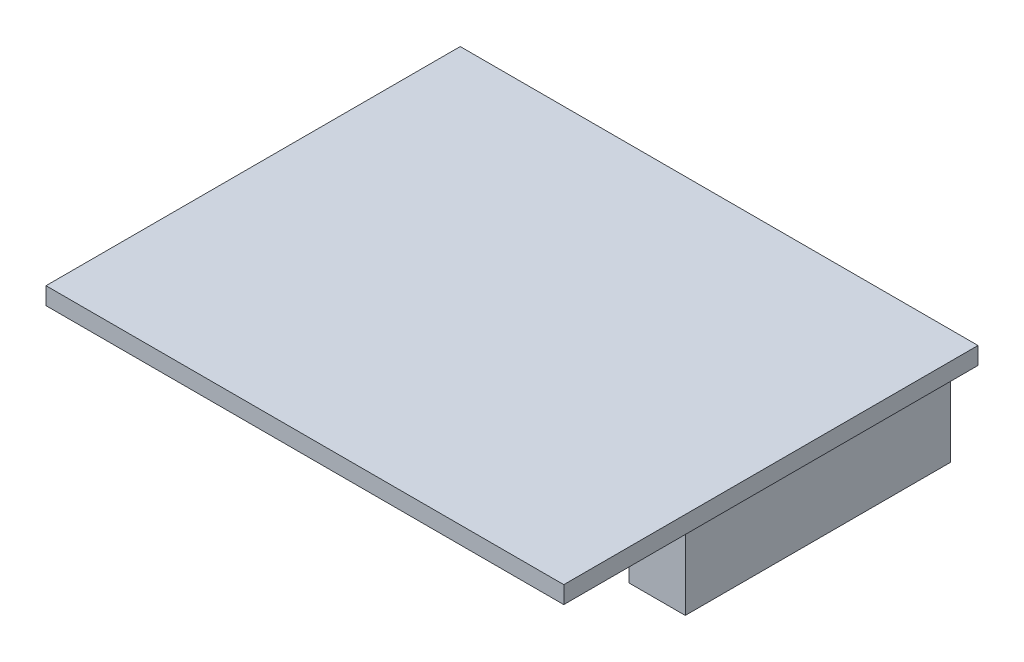
ISO-10303-21;
HEADER;
FILE_DESCRIPTION(('STEP AP214'),'2;1');
FILE_NAME('part.step','',(''),(''),'','','');
FILE_SCHEMA(('AUTOMOTIVE_DESIGN { 1 0 10303 214 1 1 1 1 }'));
ENDSEC;
DATA;
#1=APPLICATION_CONTEXT('core data for automotive mechanical design processes');
#2=APPLICATION_PROTOCOL_DEFINITION('international standard','automotive_design',2000,#1);
#3=PRODUCT_CONTEXT('',#1,'mechanical');
#4=PRODUCT('Part','Part','',(#3));
#5=PRODUCT_RELATED_PRODUCT_CATEGORY('part','',(#4));
#6=PRODUCT_DEFINITION_FORMATION('','',#4);
#7=PRODUCT_DEFINITION_CONTEXT('part definition',#1,'design');
#8=PRODUCT_DEFINITION('design','',#6,#7);
#9=PRODUCT_DEFINITION_SHAPE('','',#8);
#10=(LENGTH_UNIT() NAMED_UNIT(*) SI_UNIT(.MILLI.,.METRE.));
#11=(NAMED_UNIT(*) PLANE_ANGLE_UNIT() SI_UNIT($,.RADIAN.));
#12=(NAMED_UNIT(*) SI_UNIT($,.STERADIAN.) SOLID_ANGLE_UNIT());
#13=UNCERTAINTY_MEASURE_WITH_UNIT(LENGTH_MEASURE(1.E-05),#10,'distance_accuracy_value','');
#14=(GEOMETRIC_REPRESENTATION_CONTEXT(3) GLOBAL_UNCERTAINTY_ASSIGNED_CONTEXT((#13)) GLOBAL_UNIT_ASSIGNED_CONTEXT((#10,
#11,#12)) REPRESENTATION_CONTEXT('',''));
#15=CARTESIAN_POINT('',(0.,0.,0.));
#16=DIRECTION('',(0.,0.,1.));
#17=DIRECTION('',(1.,0.,0.));
#18=AXIS2_PLACEMENT_3D('',#15,#16,#17);
#19=CARTESIAN_POINT('',(0.,0.,0.));
#20=DIRECTION('',(0.,-1.,0.));
#21=DIRECTION('',(0.,0.,-1.));
#22=AXIS2_PLACEMENT_3D('',#19,#20,#21);
#23=PLANE('',#22);
#24=DIRECTION('',(0.,0.,-1.));
#25=VECTOR('',#24,1.);
#26=CARTESIAN_POINT('',(25.4,0.,20.32));
#27=LINE('',#26,#25);
#28=CARTESIAN_POINT('',(25.4,0.,20.32));
#29=VERTEX_POINT('',#28);
#30=CARTESIAN_POINT('',(25.4,0.,-20.32));
#31=VERTEX_POINT('',#30);
#32=EDGE_CURVE('E191',#29,#31,#27,.T.);
#33=ORIENTED_EDGE('',*,*,#32,.F.);
#34=DIRECTION('',(1.,0.,0.));
#35=VECTOR('',#34,1.);
#36=CARTESIAN_POINT('',(-25.4,0.,20.32));
#37=LINE('',#36,#35);
#38=CARTESIAN_POINT('',(-25.4,0.,20.32));
#39=VERTEX_POINT('',#38);
#40=EDGE_CURVE('E196',#39,#29,#37,.T.);
#41=ORIENTED_EDGE('',*,*,#40,.F.);
#42=DIRECTION('',(0.,0.,1.));
#43=VECTOR('',#42,1.);
#44=CARTESIAN_POINT('',(-25.4,0.,20.32));
#45=LINE('',#44,#43);
#46=CARTESIAN_POINT('',(-25.4,0.,-20.32));
#47=VERTEX_POINT('',#46);
#48=EDGE_CURVE('E207',#47,#39,#45,.T.);
#49=ORIENTED_EDGE('',*,*,#48,.F.);
#50=DIRECTION('',(-1.,0.,0.));
#51=VECTOR('',#50,1.);
#52=CARTESIAN_POINT('',(-25.4,0.,-20.32));
#53=LINE('',#52,#51);
#54=EDGE_CURVE('E205',#31,#47,#53,.T.);
#55=ORIENTED_EDGE('',*,*,#54,.F.);
#56=EDGE_LOOP('',(#33,#41,#49,#55));
#57=FACE_BOUND('',#56,.T.);
#58=DIRECTION('',(-1.,0.,0.));
#59=VECTOR('',#58,1.);
#60=CARTESIAN_POINT('',(-24.4,0.,6.68));
#61=LINE('',#60,#59);
#62=CARTESIAN_POINT('',(-19.4,0.,6.68));
#63=VERTEX_POINT('',#62);
#64=CARTESIAN_POINT('',(-24.4,0.,6.68));
#65=VERTEX_POINT('',#64);
#66=EDGE_CURVE('E177',#63,#65,#61,.T.);
#67=ORIENTED_EDGE('',*,*,#66,.F.);
#68=DIRECTION('',(0.,0.,1.));
#69=VECTOR('',#68,1.);
#70=CARTESIAN_POINT('',(-19.4,0.,-19.32));
#71=LINE('',#70,#69);
#72=CARTESIAN_POINT('',(-19.4,0.,-19.32));
#73=VERTEX_POINT('',#72);
#74=EDGE_CURVE('E174',#73,#63,#71,.T.);
#75=ORIENTED_EDGE('',*,*,#74,.F.);
#76=DIRECTION('',(1.,0.,0.));
#77=VECTOR('',#76,1.);
#78=CARTESIAN_POINT('',(-24.4,0.,-19.32));
#79=LINE('',#78,#77);
#80=CARTESIAN_POINT('',(-24.4,0.,-19.32));
#81=VERTEX_POINT('',#80);
#82=EDGE_CURVE('E167',#81,#73,#79,.T.);
#83=ORIENTED_EDGE('',*,*,#82,.F.);
#84=DIRECTION('',(0.,0.,-1.));
#85=VECTOR('',#84,1.);
#86=CARTESIAN_POINT('',(-24.4,0.,-19.32));
#87=LINE('',#86,#85);
#88=EDGE_CURVE('E180',#65,#81,#87,.T.);
#89=ORIENTED_EDGE('',*,*,#88,.F.);
#90=EDGE_LOOP('',(#67,#75,#83,#89));
#91=FACE_BOUND('',#90,.T.);
#92=DIRECTION('',(0.,0.,1.));
#93=VECTOR('',#92,1.);
#94=CARTESIAN_POINT('',(23.68,0.,-19.32));
#95=LINE('',#94,#93);
#96=CARTESIAN_POINT('',(23.68,0.,-19.32));
#97=VERTEX_POINT('',#96);
#98=CARTESIAN_POINT('',(23.68,0.,6.68));
#99=VERTEX_POINT('',#98);
#100=EDGE_CURVE('E144',#97,#99,#95,.T.);
#101=ORIENTED_EDGE('',*,*,#100,.F.);
#102=DIRECTION('',(1.,0.,0.));
#103=VECTOR('',#102,1.);
#104=CARTESIAN_POINT('',(18.18,0.,-19.32));
#105=LINE('',#104,#103);
#106=CARTESIAN_POINT('',(18.18,0.,-19.32));
#107=VERTEX_POINT('',#106);
#108=EDGE_CURVE('E53',#107,#97,#105,.T.);
#109=ORIENTED_EDGE('',*,*,#108,.F.);
#110=DIRECTION('',(0.,0.,-1.));
#111=VECTOR('',#110,1.);
#112=CARTESIAN_POINT('',(18.18,0.,-19.32));
#113=LINE('',#112,#111);
#114=CARTESIAN_POINT('',(18.18,0.,6.68));
#115=VERTEX_POINT('',#114);
#116=EDGE_CURVE('E150',#115,#107,#113,.T.);
#117=ORIENTED_EDGE('',*,*,#116,.F.);
#118=DIRECTION('',(-1.,0.,0.));
#119=VECTOR('',#118,1.);
#120=CARTESIAN_POINT('',(18.18,0.,6.68));
#121=LINE('',#120,#119);
#122=EDGE_CURVE('E135',#99,#115,#121,.T.);
#123=ORIENTED_EDGE('',*,*,#122,.F.);
#124=EDGE_LOOP('',(#101,#109,#117,#123));
#125=FACE_BOUND('',#124,.T.);
#126=ADVANCED_FACE('F38',(#57,#91,#125),#23,.T.);
#127=CARTESIAN_POINT('',(25.4,1.7,20.32));
#128=DIRECTION('',(-1.,0.,0.));
#129=DIRECTION('',(0.,0.,1.));
#130=AXIS2_PLACEMENT_3D('',#127,#128,#129);
#131=PLANE('',#130);
#132=ORIENTED_EDGE('',*,*,#32,.T.);
#133=DIRECTION('',(0.,-1.,0.));
#134=VECTOR('',#133,1.);
#135=CARTESIAN_POINT('',(25.4,1.7,-20.32));
#136=LINE('',#135,#134);
#137=CARTESIAN_POINT('',(25.4,1.7,-20.32));
#138=VERTEX_POINT('',#137);
#139=EDGE_CURVE('E11',#138,#31,#136,.T.);
#140=ORIENTED_EDGE('',*,*,#139,.F.);
#141=DIRECTION('',(0.,0.,-1.));
#142=VECTOR('',#141,1.);
#143=CARTESIAN_POINT('',(25.4,1.7,20.32));
#144=LINE('',#143,#142);
#145=CARTESIAN_POINT('',(25.4,1.7,20.32));
#146=VERTEX_POINT('',#145);
#147=EDGE_CURVE('E192',#146,#138,#144,.T.);
#148=ORIENTED_EDGE('',*,*,#147,.F.);
#149=DIRECTION('',(0.,-1.,0.));
#150=VECTOR('',#149,1.);
#151=CARTESIAN_POINT('',(25.4,1.7,20.32));
#152=LINE('',#151,#150);
#153=EDGE_CURVE('E202',#146,#29,#152,.T.);
#154=ORIENTED_EDGE('',*,*,#153,.T.);
#155=EDGE_LOOP('',(#132,#140,#148,#154));
#156=FACE_BOUND('',#155,.T.);
#157=ADVANCED_FACE('F40',(#156),#131,.F.);
#158=CARTESIAN_POINT('',(-25.4,1.7,-20.32));
#159=DIRECTION('',(0.,0.,1.));
#160=DIRECTION('',(1.,0.,0.));
#161=AXIS2_PLACEMENT_3D('',#158,#159,#160);
#162=PLANE('',#161);
#163=ORIENTED_EDGE('',*,*,#54,.T.);
#164=DIRECTION('',(0.,-1.,0.));
#165=VECTOR('',#164,1.);
#166=CARTESIAN_POINT('',(-25.4,1.7,-20.32));
#167=LINE('',#166,#165);
#168=CARTESIAN_POINT('',(-25.4,1.7,-20.32));
#169=VERTEX_POINT('',#168);
#170=EDGE_CURVE('E46',#169,#47,#167,.T.);
#171=ORIENTED_EDGE('',*,*,#170,.F.);
#172=DIRECTION('',(-1.,0.,0.));
#173=VECTOR('',#172,1.);
#174=CARTESIAN_POINT('',(-25.4,1.7,-20.32));
#175=LINE('',#174,#173);
#176=EDGE_CURVE('E195',#138,#169,#175,.T.);
#177=ORIENTED_EDGE('',*,*,#176,.F.);
#178=ORIENTED_EDGE('',*,*,#139,.T.);
#179=EDGE_LOOP('',(#163,#171,#177,#178));
#180=FACE_BOUND('',#179,.T.);
#181=ADVANCED_FACE('F235',(#180),#162,.F.);
#182=CARTESIAN_POINT('',(-25.4,1.7,20.32));
#183=DIRECTION('',(1.,0.,0.));
#184=DIRECTION('',(0.,0.,-1.));
#185=AXIS2_PLACEMENT_3D('',#182,#183,#184);
#186=PLANE('',#185);
#187=ORIENTED_EDGE('',*,*,#48,.T.);
#188=DIRECTION('',(0.,-1.,0.));
#189=VECTOR('',#188,1.);
#190=CARTESIAN_POINT('',(-25.4,1.7,20.32));
#191=LINE('',#190,#189);
#192=CARTESIAN_POINT('',(-25.4,1.7,20.32));
#193=VERTEX_POINT('',#192);
#194=EDGE_CURVE('E212',#193,#39,#191,.T.);
#195=ORIENTED_EDGE('',*,*,#194,.F.);
#196=DIRECTION('',(0.,0.,1.));
#197=VECTOR('',#196,1.);
#198=CARTESIAN_POINT('',(-25.4,1.7,20.32));
#199=LINE('',#198,#197);
#200=EDGE_CURVE('E198',#169,#193,#199,.T.);
#201=ORIENTED_EDGE('',*,*,#200,.F.);
#202=ORIENTED_EDGE('',*,*,#170,.T.);
#203=EDGE_LOOP('',(#187,#195,#201,#202));
#204=FACE_BOUND('',#203,.T.);
#205=ADVANCED_FACE('F219',(#204),#186,.F.);
#206=CARTESIAN_POINT('',(-25.4,1.7,20.32));
#207=DIRECTION('',(0.,0.,-1.));
#208=DIRECTION('',(-1.,0.,0.));
#209=AXIS2_PLACEMENT_3D('',#206,#207,#208);
#210=PLANE('',#209);
#211=ORIENTED_EDGE('',*,*,#40,.T.);
#212=ORIENTED_EDGE('',*,*,#153,.F.);
#213=DIRECTION('',(1.,0.,0.));
#214=VECTOR('',#213,1.);
#215=CARTESIAN_POINT('',(-25.4,1.7,20.32));
#216=LINE('',#215,#214);
#217=EDGE_CURVE('E200',#193,#146,#216,.T.);
#218=ORIENTED_EDGE('',*,*,#217,.F.);
#219=ORIENTED_EDGE('',*,*,#194,.T.);
#220=EDGE_LOOP('',(#211,#212,#218,#219));
#221=FACE_BOUND('',#220,.T.);
#222=ADVANCED_FACE('F228',(#221),#210,.F.);
#223=CARTESIAN_POINT('',(0.,1.7,0.));
#224=DIRECTION('',(0.,-1.,0.));
#225=DIRECTION('',(0.,0.,-1.));
#226=AXIS2_PLACEMENT_3D('',#223,#224,#225);
#227=PLANE('',#226);
#228=ORIENTED_EDGE('',*,*,#147,.T.);
#229=ORIENTED_EDGE('',*,*,#176,.T.);
#230=ORIENTED_EDGE('',*,*,#200,.T.);
#231=ORIENTED_EDGE('',*,*,#217,.T.);
#232=EDGE_LOOP('',(#228,#229,#230,#231));
#233=FACE_BOUND('',#232,.T.);
#234=ADVANCED_FACE('F234',(#233),#227,.F.);
#235=CARTESIAN_POINT('',(-19.4,-8.6,-19.32));
#236=DIRECTION('',(-1.,0.,0.));
#237=DIRECTION('',(0.,0.,1.));
#238=AXIS2_PLACEMENT_3D('',#235,#236,#237);
#239=PLANE('',#238);
#240=ORIENTED_EDGE('',*,*,#74,.T.);
#241=DIRECTION('',(0.,1.,0.));
#242=VECTOR('',#241,1.);
#243=CARTESIAN_POINT('',(-19.4,-8.6,6.68));
#244=LINE('',#243,#242);
#245=CARTESIAN_POINT('',(-19.4,-8.6,6.68));
#246=VERTEX_POINT('',#245);
#247=EDGE_CURVE('E189',#246,#63,#244,.T.);
#248=ORIENTED_EDGE('',*,*,#247,.F.);
#249=DIRECTION('',(0.,0.,1.));
#250=VECTOR('',#249,1.);
#251=CARTESIAN_POINT('',(-19.4,-8.6,-19.32));
#252=LINE('',#251,#250);
#253=CARTESIAN_POINT('',(-19.4,-8.6,-19.32));
#254=VERTEX_POINT('',#253);
#255=EDGE_CURVE('E163',#254,#246,#252,.T.);
#256=ORIENTED_EDGE('',*,*,#255,.F.);
#257=DIRECTION('',(0.,1.,0.));
#258=VECTOR('',#257,1.);
#259=CARTESIAN_POINT('',(-19.4,-8.6,-19.32));
#260=LINE('',#259,#258);
#261=EDGE_CURVE('E173',#254,#73,#260,.T.);
#262=ORIENTED_EDGE('',*,*,#261,.T.);
#263=EDGE_LOOP('',(#240,#248,#256,#262));
#264=FACE_BOUND('',#263,.T.);
#265=ADVANCED_FACE('F253',(#264),#239,.F.);
#266=CARTESIAN_POINT('',(-24.4,-8.6,6.68));
#267=DIRECTION('',(0.,0.,-1.));
#268=DIRECTION('',(-1.,0.,0.));
#269=AXIS2_PLACEMENT_3D('',#266,#267,#268);
#270=PLANE('',#269);
#271=ORIENTED_EDGE('',*,*,#66,.T.);
#272=DIRECTION('',(0.,1.,0.));
#273=VECTOR('',#272,1.);
#274=CARTESIAN_POINT('',(-24.4,-8.6,6.68));
#275=LINE('',#274,#273);
#276=CARTESIAN_POINT('',(-24.4,-8.6,6.68));
#277=VERTEX_POINT('',#276);
#278=EDGE_CURVE('E186',#277,#65,#275,.T.);
#279=ORIENTED_EDGE('',*,*,#278,.F.);
#280=DIRECTION('',(-1.,0.,0.));
#281=VECTOR('',#280,1.);
#282=CARTESIAN_POINT('',(-24.4,-8.6,6.68));
#283=LINE('',#282,#281);
#284=EDGE_CURVE('E166',#246,#277,#283,.T.);
#285=ORIENTED_EDGE('',*,*,#284,.F.);
#286=ORIENTED_EDGE('',*,*,#247,.T.);
#287=EDGE_LOOP('',(#271,#279,#285,#286));
#288=FACE_BOUND('',#287,.T.);
#289=ADVANCED_FACE('F257',(#288),#270,.F.);
#290=CARTESIAN_POINT('',(-24.4,-8.6,-19.32));
#291=DIRECTION('',(1.,0.,0.));
#292=DIRECTION('',(0.,0.,-1.));
#293=AXIS2_PLACEMENT_3D('',#290,#291,#292);
#294=PLANE('',#293);
#295=ORIENTED_EDGE('',*,*,#88,.T.);
#296=DIRECTION('',(0.,1.,0.));
#297=VECTOR('',#296,1.);
#298=CARTESIAN_POINT('',(-24.4,-8.6,-19.32));
#299=LINE('',#298,#297);
#300=CARTESIAN_POINT('',(-24.4,-8.6,-19.32));
#301=VERTEX_POINT('',#300);
#302=EDGE_CURVE('E61',#301,#81,#299,.T.);
#303=ORIENTED_EDGE('',*,*,#302,.F.);
#304=DIRECTION('',(0.,0.,-1.));
#305=VECTOR('',#304,1.);
#306=CARTESIAN_POINT('',(-24.4,-8.6,-19.32));
#307=LINE('',#306,#305);
#308=EDGE_CURVE('E169',#277,#301,#307,.T.);
#309=ORIENTED_EDGE('',*,*,#308,.F.);
#310=ORIENTED_EDGE('',*,*,#278,.T.);
#311=EDGE_LOOP('',(#295,#303,#309,#310));
#312=FACE_BOUND('',#311,.T.);
#313=ADVANCED_FACE('F262',(#312),#294,.F.);
#314=CARTESIAN_POINT('',(-24.4,-8.6,-19.32));
#315=DIRECTION('',(0.,0.,1.));
#316=DIRECTION('',(1.,0.,0.));
#317=AXIS2_PLACEMENT_3D('',#314,#315,#316);
#318=PLANE('',#317);
#319=ORIENTED_EDGE('',*,*,#82,.T.);
#320=ORIENTED_EDGE('',*,*,#261,.F.);
#321=DIRECTION('',(1.,0.,0.));
#322=VECTOR('',#321,1.);
#323=CARTESIAN_POINT('',(-24.4,-8.6,-19.32));
#324=LINE('',#323,#322);
#325=EDGE_CURVE('E171',#301,#254,#324,.T.);
#326=ORIENTED_EDGE('',*,*,#325,.F.);
#327=ORIENTED_EDGE('',*,*,#302,.T.);
#328=EDGE_LOOP('',(#319,#320,#326,#327));
#329=FACE_BOUND('',#328,.T.);
#330=ADVANCED_FACE('F268',(#329),#318,.F.);
#331=CARTESIAN_POINT('',(0.,-8.6,0.));
#332=DIRECTION('',(0.,1.,0.));
#333=DIRECTION('',(0.,0.,1.));
#334=AXIS2_PLACEMENT_3D('',#331,#332,#333);
#335=PLANE('',#334);
#336=ORIENTED_EDGE('',*,*,#255,.T.);
#337=ORIENTED_EDGE('',*,*,#284,.T.);
#338=ORIENTED_EDGE('',*,*,#308,.T.);
#339=ORIENTED_EDGE('',*,*,#325,.T.);
#340=EDGE_LOOP('',(#336,#337,#338,#339));
#341=FACE_BOUND('',#340,.T.);
#342=ADVANCED_FACE('F272',(#341),#335,.F.);
#343=CARTESIAN_POINT('',(18.18,-35.1753645318366,-19.32));
#344=DIRECTION('',(0.,0.,1.));
#345=DIRECTION('',(1.,0.,0.));
#346=AXIS2_PLACEMENT_3D('',#343,#344,#345);
#347=PLANE('',#346);
#348=DIRECTION('',(0.,1.,0.));
#349=VECTOR('',#348,1.);
#350=CARTESIAN_POINT('',(23.68,-35.1753645318366,-19.32));
#351=LINE('',#350,#349);
#352=CARTESIAN_POINT('',(23.68,-8.6,-19.32));
#353=VERTEX_POINT('',#352);
#354=EDGE_CURVE('E146',#353,#97,#351,.T.);
#355=ORIENTED_EDGE('',*,*,#354,.F.);
#356=DIRECTION('',(-1.,0.,0.));
#357=VECTOR('',#356,1.);
#358=CARTESIAN_POINT('',(18.18,-8.6,-19.32));
#359=LINE('',#358,#357);
#360=CARTESIAN_POINT('',(18.18,-8.60000000000001,-19.32));
#361=VERTEX_POINT('',#360);
#362=EDGE_CURVE('E140',#353,#361,#359,.T.);
#363=ORIENTED_EDGE('',*,*,#362,.T.);
#364=DIRECTION('',(0.,1.,0.));
#365=VECTOR('',#364,1.);
#366=CARTESIAN_POINT('',(18.18,-35.1753645318366,-19.32));
#367=LINE('',#366,#365);
#368=EDGE_CURVE('E157',#361,#107,#367,.T.);
#369=ORIENTED_EDGE('',*,*,#368,.T.);
#370=ORIENTED_EDGE('',*,*,#108,.T.);
#371=EDGE_LOOP('',(#355,#363,#369,#370));
#372=FACE_BOUND('',#371,.T.);
#373=ADVANCED_FACE('F275',(#372),#347,.F.);
#374=CARTESIAN_POINT('',(18.18,-35.1753645318366,-19.32));
#375=DIRECTION('',(1.,0.,0.));
#376=DIRECTION('',(0.,0.,-1.));
#377=AXIS2_PLACEMENT_3D('',#374,#375,#376);
#378=PLANE('',#377);
#379=ORIENTED_EDGE('',*,*,#368,.F.);
#380=DIRECTION('',(0.,0.,1.));
#381=VECTOR('',#380,1.);
#382=CARTESIAN_POINT('',(18.18,-8.6,-19.32));
#383=LINE('',#382,#381);
#384=CARTESIAN_POINT('',(18.18,-8.6,6.68));
#385=VERTEX_POINT('',#384);
#386=EDGE_CURVE('E162',#361,#385,#383,.T.);
#387=ORIENTED_EDGE('',*,*,#386,.T.);
#388=DIRECTION('',(0.,1.,0.));
#389=VECTOR('',#388,1.);
#390=CARTESIAN_POINT('',(18.18,-35.1753645318366,6.68));
#391=LINE('',#390,#389);
#392=EDGE_CURVE('E141',#385,#115,#391,.T.);
#393=ORIENTED_EDGE('',*,*,#392,.T.);
#394=ORIENTED_EDGE('',*,*,#116,.T.);
#395=EDGE_LOOP('',(#379,#387,#393,#394));
#396=FACE_BOUND('',#395,.T.);
#397=ADVANCED_FACE('F282',(#396),#378,.F.);
#398=CARTESIAN_POINT('',(18.18,-35.1753645318366,6.68));
#399=DIRECTION('',(0.,0.,-1.));
#400=DIRECTION('',(-1.,0.,0.));
#401=AXIS2_PLACEMENT_3D('',#398,#399,#400);
#402=PLANE('',#401);
#403=ORIENTED_EDGE('',*,*,#392,.F.);
#404=DIRECTION('',(1.,0.,0.));
#405=VECTOR('',#404,1.);
#406=CARTESIAN_POINT('',(18.18,-8.6,6.68));
#407=LINE('',#406,#405);
#408=CARTESIAN_POINT('',(23.68,-8.6,6.68));
#409=VERTEX_POINT('',#408);
#410=EDGE_CURVE('E137',#385,#409,#407,.T.);
#411=ORIENTED_EDGE('',*,*,#410,.T.);
#412=DIRECTION('',(0.,1.,0.));
#413=VECTOR('',#412,1.);
#414=CARTESIAN_POINT('',(23.68,-35.1753645318366,6.68));
#415=LINE('',#414,#413);
#416=EDGE_CURVE('E130',#409,#99,#415,.T.);
#417=ORIENTED_EDGE('',*,*,#416,.T.);
#418=ORIENTED_EDGE('',*,*,#122,.T.);
#419=EDGE_LOOP('',(#403,#411,#417,#418));
#420=FACE_BOUND('',#419,.T.);
#421=ADVANCED_FACE('F133',(#420),#402,.F.);
#422=CARTESIAN_POINT('',(23.68,-35.1753645318366,-19.32));
#423=DIRECTION('',(-1.,0.,0.));
#424=DIRECTION('',(0.,0.,1.));
#425=AXIS2_PLACEMENT_3D('',#422,#423,#424);
#426=PLANE('',#425);
#427=ORIENTED_EDGE('',*,*,#416,.F.);
#428=DIRECTION('',(0.,0.,-1.));
#429=VECTOR('',#428,1.);
#430=CARTESIAN_POINT('',(23.68,-8.6,-19.32));
#431=LINE('',#430,#429);
#432=EDGE_CURVE('E178',#409,#353,#431,.T.);
#433=ORIENTED_EDGE('',*,*,#432,.T.);
#434=ORIENTED_EDGE('',*,*,#354,.T.);
#435=ORIENTED_EDGE('',*,*,#100,.T.);
#436=EDGE_LOOP('',(#427,#433,#434,#435));
#437=FACE_BOUND('',#436,.T.);
#438=ADVANCED_FACE('F145',(#437),#426,.F.);
#439=CARTESIAN_POINT('',(0.,-8.6,0.));
#440=DIRECTION('',(0.,1.,0.));
#441=DIRECTION('',(0.,0.,1.));
#442=AXIS2_PLACEMENT_3D('',#439,#440,#441);
#443=PLANE('',#442);
#444=ORIENTED_EDGE('',*,*,#410,.F.);
#445=ORIENTED_EDGE('',*,*,#386,.F.);
#446=ORIENTED_EDGE('',*,*,#362,.F.);
#447=ORIENTED_EDGE('',*,*,#432,.F.);
#448=EDGE_LOOP('',(#444,#445,#446,#447));
#449=FACE_BOUND('',#448,.T.);
#450=ADVANCED_FACE('F279',(#449),#443,.F.);
#451=CLOSED_SHELL('',(#126,#157,#181,#205,#222,#234,#265,#289,#313,#330,#342,#373,#397,#421,
#438,#450));
#452=MANIFOLD_SOLID_BREP('B2',#451);
#453=ADVANCED_BREP_SHAPE_REPRESENTATION('',(#18,#452),#14);
#454=SHAPE_DEFINITION_REPRESENTATION(#9,#453);
ENDSEC;
END-ISO-10303-21;
